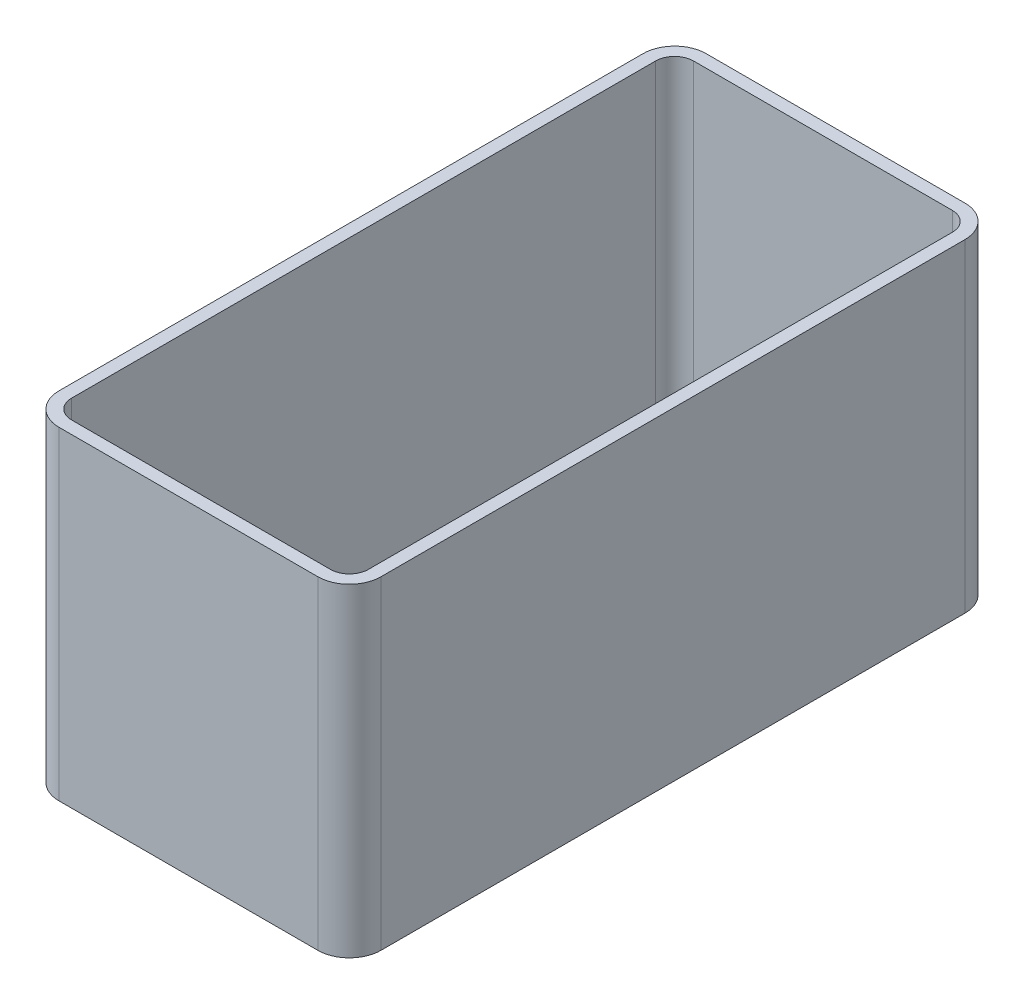
ISO-10303-21;
HEADER;
FILE_DESCRIPTION(('STEP AP214'),'2;1');
FILE_NAME('part.step','',(''),(''),'','','');
FILE_SCHEMA(('AUTOMOTIVE_DESIGN { 1 0 10303 214 1 1 1 1 }'));
ENDSEC;
DATA;
#1=APPLICATION_CONTEXT('core data for automotive mechanical design processes');
#2=APPLICATION_PROTOCOL_DEFINITION('international standard','automotive_design',2000,#1);
#3=PRODUCT_CONTEXT('',#1,'mechanical');
#4=PRODUCT('Part','Part','',(#3));
#5=PRODUCT_RELATED_PRODUCT_CATEGORY('part','',(#4));
#6=PRODUCT_DEFINITION_FORMATION('','',#4);
#7=PRODUCT_DEFINITION_CONTEXT('part definition',#1,'design');
#8=PRODUCT_DEFINITION('design','',#6,#7);
#9=PRODUCT_DEFINITION_SHAPE('','',#8);
#10=(LENGTH_UNIT() NAMED_UNIT(*) SI_UNIT(.MILLI.,.METRE.));
#11=(NAMED_UNIT(*) PLANE_ANGLE_UNIT() SI_UNIT($,.RADIAN.));
#12=(NAMED_UNIT(*) SI_UNIT($,.STERADIAN.) SOLID_ANGLE_UNIT());
#13=UNCERTAINTY_MEASURE_WITH_UNIT(LENGTH_MEASURE(1.E-05),#10,'distance_accuracy_value','');
#14=(GEOMETRIC_REPRESENTATION_CONTEXT(3) GLOBAL_UNCERTAINTY_ASSIGNED_CONTEXT((#13)) GLOBAL_UNIT_ASSIGNED_CONTEXT((#10,
#11,#12)) REPRESENTATION_CONTEXT('',''));
#15=CARTESIAN_POINT('',(0.,0.,0.));
#16=DIRECTION('',(0.,0.,1.));
#17=DIRECTION('',(1.,0.,0.));
#18=AXIS2_PLACEMENT_3D('',#15,#16,#17);
#19=CARTESIAN_POINT('',(10.2,10.25,-20.5));
#20=DIRECTION('',(-1.,0.,0.));
#21=DIRECTION('',(0.,0.,1.));
#22=AXIS2_PLACEMENT_3D('',#19,#20,#21);
#23=PLANE('',#22);
#24=DIRECTION('',(0.,0.,-1.));
#25=VECTOR('',#24,1.);
#26=CARTESIAN_POINT('',(10.2,-10.25,-20.5));
#27=LINE('',#26,#25);
#28=CARTESIAN_POINT('',(10.2,-10.25,18.5));
#29=VERTEX_POINT('',#28);
#30=CARTESIAN_POINT('',(10.2,-10.25,-18.5));
#31=VERTEX_POINT('',#30);
#32=EDGE_CURVE('E202',#29,#31,#27,.T.);
#33=ORIENTED_EDGE('',*,*,#32,.T.);
#34=DIRECTION('',(0.,-1.,0.));
#35=VECTOR('',#34,1.);
#36=CARTESIAN_POINT('',(10.2,10.25,-18.5));
#37=LINE('',#36,#35);
#38=CARTESIAN_POINT('',(10.2,10.25,-18.5));
#39=VERTEX_POINT('',#38);
#40=EDGE_CURVE('E266',#31,#39,#37,.F.);
#41=ORIENTED_EDGE('',*,*,#40,.T.);
#42=DIRECTION('',(0.,0.,-1.));
#43=VECTOR('',#42,1.);
#44=CARTESIAN_POINT('',(10.2,10.25,-20.5));
#45=LINE('',#44,#43);
#46=CARTESIAN_POINT('',(10.2,10.25,18.5));
#47=VERTEX_POINT('',#46);
#48=EDGE_CURVE('E214',#47,#39,#45,.T.);
#49=ORIENTED_EDGE('',*,*,#48,.F.);
#50=DIRECTION('',(0.,-1.,0.));
#51=VECTOR('',#50,1.);
#52=CARTESIAN_POINT('',(10.2,10.25,18.5));
#53=LINE('',#52,#51);
#54=EDGE_CURVE('E263',#47,#29,#53,.T.);
#55=ORIENTED_EDGE('',*,*,#54,.T.);
#56=EDGE_LOOP('',(#33,#41,#49,#55));
#57=FACE_BOUND('',#56,.T.);
#58=ADVANCED_FACE('F33',(#57),#23,.F.);
#59=CARTESIAN_POINT('',(-10.2,10.25,-20.5));
#60=DIRECTION('',(0.,0.,1.));
#61=DIRECTION('',(1.,0.,0.));
#62=AXIS2_PLACEMENT_3D('',#59,#60,#61);
#63=PLANE('',#62);
#64=DIRECTION('',(-1.,0.,0.));
#65=VECTOR('',#64,1.);
#66=CARTESIAN_POINT('',(-10.2,-10.25,-20.5));
#67=LINE('',#66,#65);
#68=CARTESIAN_POINT('',(8.2,-10.25,-20.5));
#69=VERTEX_POINT('',#68);
#70=CARTESIAN_POINT('',(-8.2,-10.25,-20.5));
#71=VERTEX_POINT('',#70);
#72=EDGE_CURVE('E230',#69,#71,#67,.T.);
#73=ORIENTED_EDGE('',*,*,#72,.T.);
#74=DIRECTION('',(0.,-1.,0.));
#75=VECTOR('',#74,1.);
#76=CARTESIAN_POINT('',(-8.2,10.25,-20.5));
#77=LINE('',#76,#75);
#78=CARTESIAN_POINT('',(-8.2,10.25,-20.5));
#79=VERTEX_POINT('',#78);
#80=EDGE_CURVE('E253',#71,#79,#77,.F.);
#81=ORIENTED_EDGE('',*,*,#80,.T.);
#82=DIRECTION('',(-1.,0.,0.));
#83=VECTOR('',#82,1.);
#84=CARTESIAN_POINT('',(-10.2,10.25,-20.5));
#85=LINE('',#84,#83);
#86=CARTESIAN_POINT('',(8.2,10.25,-20.5));
#87=VERTEX_POINT('',#86);
#88=EDGE_CURVE('E217',#87,#79,#85,.T.);
#89=ORIENTED_EDGE('',*,*,#88,.F.);
#90=DIRECTION('',(0.,-1.,0.));
#91=VECTOR('',#90,1.);
#92=CARTESIAN_POINT('',(8.2,10.25,-20.5));
#93=LINE('',#92,#91);
#94=EDGE_CURVE('E250',#87,#69,#93,.T.);
#95=ORIENTED_EDGE('',*,*,#94,.T.);
#96=EDGE_LOOP('',(#73,#81,#89,#95));
#97=FACE_BOUND('',#96,.T.);
#98=ADVANCED_FACE('F294',(#97),#63,.F.);
#99=CARTESIAN_POINT('',(-10.2,10.25,-20.5));
#100=DIRECTION('',(1.,0.,0.));
#101=DIRECTION('',(0.,0.,-1.));
#102=AXIS2_PLACEMENT_3D('',#99,#100,#101);
#103=PLANE('',#102);
#104=DIRECTION('',(0.,0.,1.));
#105=VECTOR('',#104,1.);
#106=CARTESIAN_POINT('',(-10.2,10.25,-20.5));
#107=LINE('',#106,#105);
#108=CARTESIAN_POINT('',(-10.2,10.25,-18.5));
#109=VERTEX_POINT('',#108);
#110=CARTESIAN_POINT('',(-10.2,10.25,18.5));
#111=VERTEX_POINT('',#110);
#112=EDGE_CURVE('E221',#109,#111,#107,.T.);
#113=ORIENTED_EDGE('',*,*,#112,.F.);
#114=DIRECTION('',(0.,-1.,0.));
#115=VECTOR('',#114,1.);
#116=CARTESIAN_POINT('',(-10.2,10.25,-18.5));
#117=LINE('',#116,#115);
#118=CARTESIAN_POINT('',(-10.2,-10.25,-18.5));
#119=VERTEX_POINT('',#118);
#120=EDGE_CURVE('E239',#109,#119,#117,.T.);
#121=ORIENTED_EDGE('',*,*,#120,.T.);
#122=DIRECTION('',(0.,0.,1.));
#123=VECTOR('',#122,1.);
#124=CARTESIAN_POINT('',(-10.2,-10.25,-20.5));
#125=LINE('',#124,#123);
#126=CARTESIAN_POINT('',(-10.2,-10.25,18.5));
#127=VERTEX_POINT('',#126);
#128=EDGE_CURVE('E233',#119,#127,#125,.T.);
#129=ORIENTED_EDGE('',*,*,#128,.T.);
#130=DIRECTION('',(0.,-1.,0.));
#131=VECTOR('',#130,1.);
#132=CARTESIAN_POINT('',(-10.2,10.25,18.5));
#133=LINE('',#132,#131);
#134=EDGE_CURVE('E227',#127,#111,#133,.F.);
#135=ORIENTED_EDGE('',*,*,#134,.T.);
#136=EDGE_LOOP('',(#113,#121,#129,#135));
#137=FACE_BOUND('',#136,.T.);
#138=ADVANCED_FACE('F302',(#137),#103,.F.);
#139=CARTESIAN_POINT('',(-10.2,10.25,20.5));
#140=DIRECTION('',(0.,0.,-1.));
#141=DIRECTION('',(-1.,0.,0.));
#142=AXIS2_PLACEMENT_3D('',#139,#140,#141);
#143=PLANE('',#142);
#144=DIRECTION('',(1.,0.,0.));
#145=VECTOR('',#144,1.);
#146=CARTESIAN_POINT('',(-10.2,-10.25,20.5));
#147=LINE('',#146,#145);
#148=CARTESIAN_POINT('',(-8.2,-10.25,20.5));
#149=VERTEX_POINT('',#148);
#150=CARTESIAN_POINT('',(8.2,-10.25,20.5));
#151=VERTEX_POINT('',#150);
#152=EDGE_CURVE('E218',#149,#151,#147,.T.);
#153=ORIENTED_EDGE('',*,*,#152,.T.);
#154=DIRECTION('',(0.,-1.,0.));
#155=VECTOR('',#154,1.);
#156=CARTESIAN_POINT('',(8.2,10.25,20.5));
#157=LINE('',#156,#155);
#158=CARTESIAN_POINT('',(8.2,10.25,20.5));
#159=VERTEX_POINT('',#158);
#160=EDGE_CURVE('E11',#151,#159,#157,.F.);
#161=ORIENTED_EDGE('',*,*,#160,.T.);
#162=DIRECTION('',(1.,0.,0.));
#163=VECTOR('',#162,1.);
#164=CARTESIAN_POINT('',(-10.2,10.25,20.5));
#165=LINE('',#164,#163);
#166=CARTESIAN_POINT('',(-8.2,10.25,20.5));
#167=VERTEX_POINT('',#166);
#168=EDGE_CURVE('E224',#167,#159,#165,.T.);
#169=ORIENTED_EDGE('',*,*,#168,.F.);
#170=DIRECTION('',(0.,-1.,0.));
#171=VECTOR('',#170,1.);
#172=CARTESIAN_POINT('',(-8.2,10.25,20.5));
#173=LINE('',#172,#171);
#174=EDGE_CURVE('E41',#167,#149,#173,.T.);
#175=ORIENTED_EDGE('',*,*,#174,.T.);
#176=EDGE_LOOP('',(#153,#161,#169,#175));
#177=FACE_BOUND('',#176,.T.);
#178=ADVANCED_FACE('F272',(#177),#143,.F.);
#179=CARTESIAN_POINT('',(0.,10.25,0.));
#180=DIRECTION('',(0.,1.,0.));
#181=DIRECTION('',(0.,0.,1.));
#182=AXIS2_PLACEMENT_3D('',#179,#180,#181);
#183=PLANE('',#182);
#184=CARTESIAN_POINT('',(8.2,10.25,-18.5));
#185=DIRECTION('',(0.,1.,0.));
#186=DIRECTION('',(0.,0.,1.));
#187=AXIS2_PLACEMENT_3D('',#184,#185,#186);
#188=CIRCLE('',#187,1.2);
#189=CARTESIAN_POINT('',(9.4,10.25,-18.5));
#190=VERTEX_POINT('',#189);
#191=CARTESIAN_POINT('',(8.2,10.25,-19.7));
#192=VERTEX_POINT('',#191);
#193=EDGE_CURVE('E48',#190,#192,#188,.T.);
#194=ORIENTED_EDGE('',*,*,#193,.F.);
#195=DIRECTION('',(0.,0.,-1.));
#196=VECTOR('',#195,1.);
#197=CARTESIAN_POINT('',(9.4,10.25,18.5));
#198=LINE('',#197,#196);
#199=CARTESIAN_POINT('',(9.4,10.25,18.5));
#200=VERTEX_POINT('',#199);
#201=EDGE_CURVE('E164',#200,#190,#198,.T.);
#202=ORIENTED_EDGE('',*,*,#201,.F.);
#203=CARTESIAN_POINT('',(8.2,10.25,18.5));
#204=DIRECTION('',(0.,1.,0.));
#205=DIRECTION('',(0.,0.,1.));
#206=AXIS2_PLACEMENT_3D('',#203,#204,#205);
#207=CIRCLE('',#206,1.2);
#208=CARTESIAN_POINT('',(8.2,10.25,19.7));
#209=VERTEX_POINT('',#208);
#210=EDGE_CURVE('E167',#209,#200,#207,.T.);
#211=ORIENTED_EDGE('',*,*,#210,.F.);
#212=DIRECTION('',(1.,0.,0.));
#213=VECTOR('',#212,1.);
#214=CARTESIAN_POINT('',(-8.2,10.25,19.7));
#215=LINE('',#214,#213);
#216=CARTESIAN_POINT('',(-8.2,10.25,19.7));
#217=VERTEX_POINT('',#216);
#218=EDGE_CURVE('E195',#217,#209,#215,.T.);
#219=ORIENTED_EDGE('',*,*,#218,.F.);
#220=CARTESIAN_POINT('',(-8.2,10.25,18.5));
#221=DIRECTION('',(0.,1.,0.));
#222=DIRECTION('',(0.,0.,1.));
#223=AXIS2_PLACEMENT_3D('',#220,#221,#222);
#224=CIRCLE('',#223,1.2);
#225=CARTESIAN_POINT('',(-9.4,10.25,18.5));
#226=VERTEX_POINT('',#225);
#227=EDGE_CURVE('E192',#226,#217,#224,.T.);
#228=ORIENTED_EDGE('',*,*,#227,.F.);
#229=DIRECTION('',(0.,0.,1.));
#230=VECTOR('',#229,1.);
#231=CARTESIAN_POINT('',(-9.4,10.25,-18.5));
#232=LINE('',#231,#230);
#233=CARTESIAN_POINT('',(-9.4,10.25,-18.5));
#234=VERTEX_POINT('',#233);
#235=EDGE_CURVE('E189',#234,#226,#232,.T.);
#236=ORIENTED_EDGE('',*,*,#235,.F.);
#237=CARTESIAN_POINT('',(-8.2,10.25,-18.5));
#238=DIRECTION('',(0.,1.,0.));
#239=DIRECTION('',(0.,0.,1.));
#240=AXIS2_PLACEMENT_3D('',#237,#238,#239);
#241=CIRCLE('',#240,1.2);
#242=CARTESIAN_POINT('',(-8.2,10.25,-19.7));
#243=VERTEX_POINT('',#242);
#244=EDGE_CURVE('E186',#243,#234,#241,.T.);
#245=ORIENTED_EDGE('',*,*,#244,.F.);
#246=DIRECTION('',(-1.,0.,0.));
#247=VECTOR('',#246,1.);
#248=CARTESIAN_POINT('',(8.2,10.25,-19.7));
#249=LINE('',#248,#247);
#250=EDGE_CURVE('E184',#192,#243,#249,.T.);
#251=ORIENTED_EDGE('',*,*,#250,.F.);
#252=EDGE_LOOP('',(#194,#202,#211,#219,#228,#236,#245,#251));
#253=FACE_BOUND('',#252,.T.);
#254=ORIENTED_EDGE('',*,*,#88,.T.);
#255=CARTESIAN_POINT('',(-8.2,10.25,-18.5));
#256=DIRECTION('',(0.,1.,0.));
#257=DIRECTION('',(0.,0.,1.));
#258=AXIS2_PLACEMENT_3D('',#255,#256,#257);
#259=CIRCLE('',#258,2.);
#260=EDGE_CURVE('E261',#79,#109,#259,.T.);
#261=ORIENTED_EDGE('',*,*,#260,.T.);
#262=ORIENTED_EDGE('',*,*,#112,.T.);
#263=CARTESIAN_POINT('',(-8.2,10.25,18.5));
#264=DIRECTION('',(0.,1.,0.));
#265=DIRECTION('',(0.,0.,1.));
#266=AXIS2_PLACEMENT_3D('',#263,#264,#265);
#267=CIRCLE('',#266,2.);
#268=EDGE_CURVE('E255',#111,#167,#267,.T.);
#269=ORIENTED_EDGE('',*,*,#268,.T.);
#270=ORIENTED_EDGE('',*,*,#168,.T.);
#271=CARTESIAN_POINT('',(8.2,10.25,18.5));
#272=DIRECTION('',(0.,1.,0.));
#273=DIRECTION('',(0.,0.,1.));
#274=AXIS2_PLACEMENT_3D('',#271,#272,#273);
#275=CIRCLE('',#274,2.);
#276=EDGE_CURVE('E257',#159,#47,#275,.T.);
#277=ORIENTED_EDGE('',*,*,#276,.T.);
#278=ORIENTED_EDGE('',*,*,#48,.T.);
#279=CARTESIAN_POINT('',(8.2,10.25,-18.5));
#280=DIRECTION('',(0.,1.,0.));
#281=DIRECTION('',(0.,0.,1.));
#282=AXIS2_PLACEMENT_3D('',#279,#280,#281);
#283=CIRCLE('',#282,2.);
#284=EDGE_CURVE('E259',#39,#87,#283,.T.);
#285=ORIENTED_EDGE('',*,*,#284,.T.);
#286=EDGE_LOOP('',(#254,#261,#262,#269,#270,#277,#278,#285));
#287=FACE_BOUND('',#286,.T.);
#288=ADVANCED_FACE('F287',(#253,#287),#183,.T.);
#289=CARTESIAN_POINT('',(0.,-10.25,0.));
#290=DIRECTION('',(0.,1.,0.));
#291=DIRECTION('',(0.,0.,1.));
#292=AXIS2_PLACEMENT_3D('',#289,#290,#291);
#293=PLANE('',#292);
#294=DIRECTION('',(0.,0.,-1.));
#295=VECTOR('',#294,1.);
#296=CARTESIAN_POINT('',(9.4,-10.25,18.5));
#297=LINE('',#296,#295);
#298=CARTESIAN_POINT('',(9.4,-10.25,18.5));
#299=VERTEX_POINT('',#298);
#300=CARTESIAN_POINT('',(9.4,-10.25,-18.5));
#301=VERTEX_POINT('',#300);
#302=EDGE_CURVE('E153',#299,#301,#297,.T.);
#303=ORIENTED_EDGE('',*,*,#302,.T.);
#304=CARTESIAN_POINT('',(8.2,-10.25,-18.5));
#305=DIRECTION('',(0.,1.,0.));
#306=DIRECTION('',(0.,0.,1.));
#307=AXIS2_PLACEMENT_3D('',#304,#305,#306);
#308=CIRCLE('',#307,1.2);
#309=CARTESIAN_POINT('',(8.2,-10.25,-19.7));
#310=VERTEX_POINT('',#309);
#311=EDGE_CURVE('E147',#301,#310,#308,.T.);
#312=ORIENTED_EDGE('',*,*,#311,.T.);
#313=DIRECTION('',(-1.,0.,0.));
#314=VECTOR('',#313,1.);
#315=CARTESIAN_POINT('',(8.2,-10.25,-19.7));
#316=LINE('',#315,#314);
#317=CARTESIAN_POINT('',(-8.2,-10.25,-19.7));
#318=VERTEX_POINT('',#317);
#319=EDGE_CURVE('E156',#310,#318,#316,.T.);
#320=ORIENTED_EDGE('',*,*,#319,.T.);
#321=CARTESIAN_POINT('',(-8.2,-10.25,-18.5));
#322=DIRECTION('',(0.,1.,0.));
#323=DIRECTION('',(0.,0.,1.));
#324=AXIS2_PLACEMENT_3D('',#321,#322,#323);
#325=CIRCLE('',#324,1.2);
#326=CARTESIAN_POINT('',(-9.4,-10.25,-18.5));
#327=VERTEX_POINT('',#326);
#328=EDGE_CURVE('E56',#318,#327,#325,.T.);
#329=ORIENTED_EDGE('',*,*,#328,.T.);
#330=DIRECTION('',(0.,0.,1.));
#331=VECTOR('',#330,1.);
#332=CARTESIAN_POINT('',(-9.4,-10.25,-18.5));
#333=LINE('',#332,#331);
#334=CARTESIAN_POINT('',(-9.4,-10.25,18.5));
#335=VERTEX_POINT('',#334);
#336=EDGE_CURVE('E171',#327,#335,#333,.T.);
#337=ORIENTED_EDGE('',*,*,#336,.T.);
#338=CARTESIAN_POINT('',(-8.2,-10.25,18.5));
#339=DIRECTION('',(0.,1.,0.));
#340=DIRECTION('',(0.,0.,1.));
#341=AXIS2_PLACEMENT_3D('',#338,#339,#340);
#342=CIRCLE('',#341,1.2);
#343=CARTESIAN_POINT('',(-8.2,-10.25,19.7));
#344=VERTEX_POINT('',#343);
#345=EDGE_CURVE('E174',#335,#344,#342,.T.);
#346=ORIENTED_EDGE('',*,*,#345,.T.);
#347=DIRECTION('',(1.,0.,0.));
#348=VECTOR('',#347,1.);
#349=CARTESIAN_POINT('',(-8.2,-10.25,19.7));
#350=LINE('',#349,#348);
#351=CARTESIAN_POINT('',(8.2,-10.25,19.7));
#352=VERTEX_POINT('',#351);
#353=EDGE_CURVE('E177',#344,#352,#350,.T.);
#354=ORIENTED_EDGE('',*,*,#353,.T.);
#355=CARTESIAN_POINT('',(8.2,-10.25,18.5));
#356=DIRECTION('',(0.,1.,0.));
#357=DIRECTION('',(0.,0.,1.));
#358=AXIS2_PLACEMENT_3D('',#355,#356,#357);
#359=CIRCLE('',#358,1.2);
#360=EDGE_CURVE('E180',#352,#299,#359,.T.);
#361=ORIENTED_EDGE('',*,*,#360,.T.);
#362=EDGE_LOOP('',(#303,#312,#320,#329,#337,#346,#354,#361));
#363=FACE_BOUND('',#362,.T.);
#364=ORIENTED_EDGE('',*,*,#128,.F.);
#365=CARTESIAN_POINT('',(-8.2,-10.25,-18.5));
#366=DIRECTION('',(0.,1.,0.));
#367=DIRECTION('',(0.,0.,1.));
#368=AXIS2_PLACEMENT_3D('',#365,#366,#367);
#369=CIRCLE('',#368,2.);
#370=EDGE_CURVE('E248',#119,#71,#369,.F.);
#371=ORIENTED_EDGE('',*,*,#370,.T.);
#372=ORIENTED_EDGE('',*,*,#72,.F.);
#373=CARTESIAN_POINT('',(8.2,-10.25,-18.5));
#374=DIRECTION('',(0.,1.,0.));
#375=DIRECTION('',(0.,0.,1.));
#376=AXIS2_PLACEMENT_3D('',#373,#374,#375);
#377=CIRCLE('',#376,2.);
#378=EDGE_CURVE('E246',#69,#31,#377,.F.);
#379=ORIENTED_EDGE('',*,*,#378,.T.);
#380=ORIENTED_EDGE('',*,*,#32,.F.);
#381=CARTESIAN_POINT('',(8.2,-10.25,18.5));
#382=DIRECTION('',(0.,1.,0.));
#383=DIRECTION('',(0.,0.,1.));
#384=AXIS2_PLACEMENT_3D('',#381,#382,#383);
#385=CIRCLE('',#384,2.);
#386=EDGE_CURVE('E244',#29,#151,#385,.F.);
#387=ORIENTED_EDGE('',*,*,#386,.T.);
#388=ORIENTED_EDGE('',*,*,#152,.F.);
#389=CARTESIAN_POINT('',(-8.2,-10.25,18.5));
#390=DIRECTION('',(0.,1.,0.));
#391=DIRECTION('',(0.,0.,1.));
#392=AXIS2_PLACEMENT_3D('',#389,#390,#391);
#393=CIRCLE('',#392,2.);
#394=EDGE_CURVE('E242',#149,#127,#393,.F.);
#395=ORIENTED_EDGE('',*,*,#394,.T.);
#396=EDGE_LOOP('',(#364,#371,#372,#379,#380,#387,#388,#395));
#397=FACE_BOUND('',#396,.T.);
#398=ADVANCED_FACE('F160',(#363,#397),#293,.F.);
#399=CARTESIAN_POINT('',(-8.2,10.25,-18.5));
#400=DIRECTION('',(0.,-1.,0.));
#401=DIRECTION('',(0.,0.,-1.));
#402=AXIS2_PLACEMENT_3D('',#399,#400,#401);
#403=CYLINDRICAL_SURFACE('',#402,2.);
#404=ORIENTED_EDGE('',*,*,#260,.F.);
#405=ORIENTED_EDGE('',*,*,#80,.F.);
#406=ORIENTED_EDGE('',*,*,#370,.F.);
#407=ORIENTED_EDGE('',*,*,#120,.F.);
#408=EDGE_LOOP('',(#404,#405,#406,#407));
#409=FACE_BOUND('',#408,.T.);
#410=ADVANCED_FACE('F299',(#409),#403,.T.);
#411=CARTESIAN_POINT('',(8.2,10.25,-18.5));
#412=DIRECTION('',(0.,-1.,0.));
#413=DIRECTION('',(0.,0.,-1.));
#414=AXIS2_PLACEMENT_3D('',#411,#412,#413);
#415=CYLINDRICAL_SURFACE('',#414,2.);
#416=ORIENTED_EDGE('',*,*,#284,.F.);
#417=ORIENTED_EDGE('',*,*,#40,.F.);
#418=ORIENTED_EDGE('',*,*,#378,.F.);
#419=ORIENTED_EDGE('',*,*,#94,.F.);
#420=EDGE_LOOP('',(#416,#417,#418,#419));
#421=FACE_BOUND('',#420,.T.);
#422=ADVANCED_FACE('F291',(#421),#415,.T.);
#423=CARTESIAN_POINT('',(8.2,10.25,18.5));
#424=DIRECTION('',(0.,-1.,0.));
#425=DIRECTION('',(0.,0.,-1.));
#426=AXIS2_PLACEMENT_3D('',#423,#424,#425);
#427=CYLINDRICAL_SURFACE('',#426,2.);
#428=ORIENTED_EDGE('',*,*,#276,.F.);
#429=ORIENTED_EDGE('',*,*,#160,.F.);
#430=ORIENTED_EDGE('',*,*,#386,.F.);
#431=ORIENTED_EDGE('',*,*,#54,.F.);
#432=EDGE_LOOP('',(#428,#429,#430,#431));
#433=FACE_BOUND('',#432,.T.);
#434=ADVANCED_FACE('F281',(#433),#427,.T.);
#435=CARTESIAN_POINT('',(-8.2,10.25,18.5));
#436=DIRECTION('',(0.,-1.,0.));
#437=DIRECTION('',(0.,0.,-1.));
#438=AXIS2_PLACEMENT_3D('',#435,#436,#437);
#439=CYLINDRICAL_SURFACE('',#438,2.);
#440=ORIENTED_EDGE('',*,*,#268,.F.);
#441=ORIENTED_EDGE('',*,*,#134,.F.);
#442=ORIENTED_EDGE('',*,*,#394,.F.);
#443=ORIENTED_EDGE('',*,*,#174,.F.);
#444=EDGE_LOOP('',(#440,#441,#442,#443));
#445=FACE_BOUND('',#444,.T.);
#446=ADVANCED_FACE('F35',(#445),#439,.T.);
#447=CARTESIAN_POINT('',(8.2,-10.25,-18.5));
#448=DIRECTION('',(0.,1.,0.));
#449=DIRECTION('',(0.,0.,1.));
#450=AXIS2_PLACEMENT_3D('',#447,#448,#449);
#451=CYLINDRICAL_SURFACE('',#450,1.2);
#452=ORIENTED_EDGE('',*,*,#193,.T.);
#453=DIRECTION('',(0.,1.,0.));
#454=VECTOR('',#453,1.);
#455=CARTESIAN_POINT('',(8.2,-10.25,-19.7));
#456=LINE('',#455,#454);
#457=EDGE_CURVE('E143',#310,#192,#456,.T.);
#458=ORIENTED_EDGE('',*,*,#457,.F.);
#459=ORIENTED_EDGE('',*,*,#311,.F.);
#460=DIRECTION('',(0.,1.,0.));
#461=VECTOR('',#460,1.);
#462=CARTESIAN_POINT('',(9.4,-10.25,-18.5));
#463=LINE('',#462,#461);
#464=EDGE_CURVE('E200',#301,#190,#463,.T.);
#465=ORIENTED_EDGE('',*,*,#464,.T.);
#466=EDGE_LOOP('',(#452,#458,#459,#465));
#467=FACE_BOUND('',#466,.T.);
#468=ADVANCED_FACE('F145',(#467),#451,.F.);
#469=CARTESIAN_POINT('',(9.4,-10.25,18.5));
#470=DIRECTION('',(1.,0.,0.));
#471=DIRECTION('',(0.,0.,-1.));
#472=AXIS2_PLACEMENT_3D('',#469,#470,#471);
#473=PLANE('',#472);
#474=ORIENTED_EDGE('',*,*,#201,.T.);
#475=ORIENTED_EDGE('',*,*,#464,.F.);
#476=ORIENTED_EDGE('',*,*,#302,.F.);
#477=DIRECTION('',(0.,1.,0.));
#478=VECTOR('',#477,1.);
#479=CARTESIAN_POINT('',(9.4,-10.25,18.5));
#480=LINE('',#479,#478);
#481=EDGE_CURVE('E203',#299,#200,#480,.T.);
#482=ORIENTED_EDGE('',*,*,#481,.T.);
#483=EDGE_LOOP('',(#474,#475,#476,#482));
#484=FACE_BOUND('',#483,.T.);
#485=ADVANCED_FACE('F309',(#484),#473,.F.);
#486=CARTESIAN_POINT('',(8.2,-10.25,18.5));
#487=DIRECTION('',(0.,1.,0.));
#488=DIRECTION('',(0.,0.,1.));
#489=AXIS2_PLACEMENT_3D('',#486,#487,#488);
#490=CYLINDRICAL_SURFACE('',#489,1.2);
#491=ORIENTED_EDGE('',*,*,#210,.T.);
#492=ORIENTED_EDGE('',*,*,#481,.F.);
#493=ORIENTED_EDGE('',*,*,#360,.F.);
#494=DIRECTION('',(0.,1.,0.));
#495=VECTOR('',#494,1.);
#496=CARTESIAN_POINT('',(8.2,-10.25,19.7));
#497=LINE('',#496,#495);
#498=EDGE_CURVE('E205',#352,#209,#497,.T.);
#499=ORIENTED_EDGE('',*,*,#498,.T.);
#500=EDGE_LOOP('',(#491,#492,#493,#499));
#501=FACE_BOUND('',#500,.T.);
#502=ADVANCED_FACE('F369',(#501),#490,.F.);
#503=CARTESIAN_POINT('',(-8.2,-10.25,19.7));
#504=DIRECTION('',(0.,0.,1.));
#505=DIRECTION('',(1.,0.,0.));
#506=AXIS2_PLACEMENT_3D('',#503,#504,#505);
#507=PLANE('',#506);
#508=ORIENTED_EDGE('',*,*,#218,.T.);
#509=ORIENTED_EDGE('',*,*,#498,.F.);
#510=ORIENTED_EDGE('',*,*,#353,.F.);
#511=DIRECTION('',(0.,1.,0.));
#512=VECTOR('',#511,1.);
#513=CARTESIAN_POINT('',(-8.2,-10.25,19.7));
#514=LINE('',#513,#512);
#515=EDGE_CURVE('E207',#344,#217,#514,.T.);
#516=ORIENTED_EDGE('',*,*,#515,.T.);
#517=EDGE_LOOP('',(#508,#509,#510,#516));
#518=FACE_BOUND('',#517,.T.);
#519=ADVANCED_FACE('F379',(#518),#507,.F.);
#520=CARTESIAN_POINT('',(-8.2,-10.25,18.5));
#521=DIRECTION('',(0.,1.,0.));
#522=DIRECTION('',(0.,0.,1.));
#523=AXIS2_PLACEMENT_3D('',#520,#521,#522);
#524=CYLINDRICAL_SURFACE('',#523,1.2);
#525=ORIENTED_EDGE('',*,*,#227,.T.);
#526=ORIENTED_EDGE('',*,*,#515,.F.);
#527=ORIENTED_EDGE('',*,*,#345,.F.);
#528=DIRECTION('',(0.,1.,0.));
#529=VECTOR('',#528,1.);
#530=CARTESIAN_POINT('',(-9.4,-10.25,18.5));
#531=LINE('',#530,#529);
#532=EDGE_CURVE('E209',#335,#226,#531,.T.);
#533=ORIENTED_EDGE('',*,*,#532,.T.);
#534=EDGE_LOOP('',(#525,#526,#527,#533));
#535=FACE_BOUND('',#534,.T.);
#536=ADVANCED_FACE('F389',(#535),#524,.F.);
#537=CARTESIAN_POINT('',(-9.4,-10.25,-18.5));
#538=DIRECTION('',(-1.,0.,0.));
#539=DIRECTION('',(0.,0.,1.));
#540=AXIS2_PLACEMENT_3D('',#537,#538,#539);
#541=PLANE('',#540);
#542=ORIENTED_EDGE('',*,*,#235,.T.);
#543=ORIENTED_EDGE('',*,*,#532,.F.);
#544=ORIENTED_EDGE('',*,*,#336,.F.);
#545=DIRECTION('',(0.,1.,0.));
#546=VECTOR('',#545,1.);
#547=CARTESIAN_POINT('',(-9.4,-10.25,-18.5));
#548=LINE('',#547,#546);
#549=EDGE_CURVE('E211',#327,#234,#548,.T.);
#550=ORIENTED_EDGE('',*,*,#549,.T.);
#551=EDGE_LOOP('',(#542,#543,#544,#550));
#552=FACE_BOUND('',#551,.T.);
#553=ADVANCED_FACE('F399',(#552),#541,.F.);
#554=CARTESIAN_POINT('',(-8.2,-10.25,-18.5));
#555=DIRECTION('',(0.,1.,0.));
#556=DIRECTION('',(0.,0.,1.));
#557=AXIS2_PLACEMENT_3D('',#554,#555,#556);
#558=CYLINDRICAL_SURFACE('',#557,1.2);
#559=ORIENTED_EDGE('',*,*,#244,.T.);
#560=ORIENTED_EDGE('',*,*,#549,.F.);
#561=ORIENTED_EDGE('',*,*,#328,.F.);
#562=DIRECTION('',(0.,1.,0.));
#563=VECTOR('',#562,1.);
#564=CARTESIAN_POINT('',(-8.2,-10.25,-19.7));
#565=LINE('',#564,#563);
#566=EDGE_CURVE('E152',#318,#243,#565,.T.);
#567=ORIENTED_EDGE('',*,*,#566,.T.);
#568=EDGE_LOOP('',(#559,#560,#561,#567));
#569=FACE_BOUND('',#568,.T.);
#570=ADVANCED_FACE('F409',(#569),#558,.F.);
#571=CARTESIAN_POINT('',(8.2,-10.25,-19.7));
#572=DIRECTION('',(0.,0.,-1.));
#573=DIRECTION('',(-1.,0.,0.));
#574=AXIS2_PLACEMENT_3D('',#571,#572,#573);
#575=PLANE('',#574);
#576=ORIENTED_EDGE('',*,*,#250,.T.);
#577=ORIENTED_EDGE('',*,*,#566,.F.);
#578=ORIENTED_EDGE('',*,*,#319,.F.);
#579=ORIENTED_EDGE('',*,*,#457,.T.);
#580=EDGE_LOOP('',(#576,#577,#578,#579));
#581=FACE_BOUND('',#580,.T.);
#582=ADVANCED_FACE('F157',(#581),#575,.F.);
#583=CLOSED_SHELL('',(#58,#98,#138,#178,#288,#398,#410,#422,#434,#446,#468,#485,#502,#519,#536,
#553,#570,#582));
#584=MANIFOLD_SOLID_BREP('B2',#583);
#585=ADVANCED_BREP_SHAPE_REPRESENTATION('',(#18,#584),#14);
#586=SHAPE_DEFINITION_REPRESENTATION(#9,#585);
ENDSEC;
END-ISO-10303-21;
